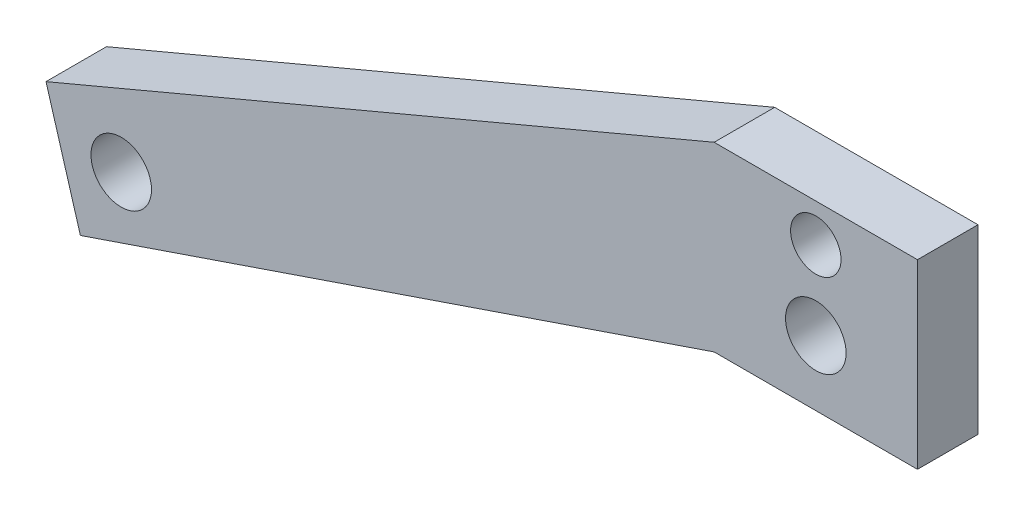
ISO-10303-21;
HEADER;
FILE_DESCRIPTION(('STEP AP214'),'2;1');
FILE_NAME('part.step','',(''),(''),'','','');
FILE_SCHEMA(('AUTOMOTIVE_DESIGN { 1 0 10303 214 1 1 1 1 }'));
ENDSEC;
DATA;
#1=APPLICATION_CONTEXT('core data for automotive mechanical design processes');
#2=APPLICATION_PROTOCOL_DEFINITION('international standard','automotive_design',2000,#1);
#3=PRODUCT_CONTEXT('',#1,'mechanical');
#4=PRODUCT('Part','Part','',(#3));
#5=PRODUCT_RELATED_PRODUCT_CATEGORY('part','',(#4));
#6=PRODUCT_DEFINITION_FORMATION('','',#4);
#7=PRODUCT_DEFINITION_CONTEXT('part definition',#1,'design');
#8=PRODUCT_DEFINITION('design','',#6,#7);
#9=PRODUCT_DEFINITION_SHAPE('','',#8);
#10=(LENGTH_UNIT() NAMED_UNIT(*) SI_UNIT(.MILLI.,.METRE.));
#11=(NAMED_UNIT(*) PLANE_ANGLE_UNIT() SI_UNIT($,.RADIAN.));
#12=(NAMED_UNIT(*) SI_UNIT($,.STERADIAN.) SOLID_ANGLE_UNIT());
#13=UNCERTAINTY_MEASURE_WITH_UNIT(LENGTH_MEASURE(1.E-05),#10,'distance_accuracy_value','');
#14=(GEOMETRIC_REPRESENTATION_CONTEXT(3) GLOBAL_UNCERTAINTY_ASSIGNED_CONTEXT((#13)) GLOBAL_UNIT_ASSIGNED_CONTEXT((#10,
#11,#12)) REPRESENTATION_CONTEXT('',''));
#15=CARTESIAN_POINT('',(0.,0.,0.));
#16=DIRECTION('',(0.,0.,1.));
#17=DIRECTION('',(1.,0.,0.));
#18=AXIS2_PLACEMENT_3D('',#15,#16,#17);
#19=CARTESIAN_POINT('',(-111.181731184165,-32.9335291699961,9.525));
#20=DIRECTION('',(-0.958819734868193,-0.284015344703924,0.));
#21=DIRECTION('',(0.284015344703924,-0.958819734868193,0.));
#22=AXIS2_PLACEMENT_3D('',#19,#20,#21);
#23=PLANE('',#22);
#24=DIRECTION('',(-0.284015344703924,0.958819734868193,0.));
#25=VECTOR('',#24,1.);
#26=CARTESIAN_POINT('',(-111.181731184165,-32.9335291699961,0.));
#27=LINE('',#26,#25);
#28=CARTESIAN_POINT('',(-115.733139183861,-17.5682332698922,0.));
#29=VERTEX_POINT('',#28);
#30=CARTESIAN_POINT('',(-121.143631500471,0.697282679346885,0.));
#31=VERTEX_POINT('',#30);
#32=EDGE_CURVE('E131',#29,#31,#27,.T.);
#33=ORIENTED_EDGE('',*,*,#32,.F.);
#34=DIRECTION('',(0.,0.,-1.));
#35=VECTOR('',#34,1.);
#36=CARTESIAN_POINT('',(-115.733139183861,-17.5682332698922,9.525));
#37=LINE('',#36,#35);
#38=CARTESIAN_POINT('',(-115.733139183861,-17.5682332698922,9.525));
#39=VERTEX_POINT('',#38);
#40=EDGE_CURVE('E11',#39,#29,#37,.T.);
#41=ORIENTED_EDGE('',*,*,#40,.F.);
#42=DIRECTION('',(-0.284015344703924,0.958819734868193,0.));
#43=VECTOR('',#42,1.);
#44=CARTESIAN_POINT('',(-111.181731184165,-32.9335291699961,9.525));
#45=LINE('',#44,#43);
#46=CARTESIAN_POINT('',(-121.143631500471,0.697282679346885,9.525));
#47=VERTEX_POINT('',#46);
#48=EDGE_CURVE('E255',#39,#47,#45,.T.);
#49=ORIENTED_EDGE('',*,*,#48,.T.);
#50=DIRECTION('',(0.,0.,-1.));
#51=VECTOR('',#50,1.);
#52=CARTESIAN_POINT('',(-121.143631500471,0.697282679346885,9.525));
#53=LINE('',#52,#51);
#54=EDGE_CURVE('E81',#47,#31,#53,.T.);
#55=ORIENTED_EDGE('',*,*,#54,.T.);
#56=EDGE_LOOP('',(#33,#41,#49,#55));
#57=FACE_BOUND('',#56,.T.);
#58=ADVANCED_FACE('F36',(#57),#23,.T.);
#59=CARTESIAN_POINT('',(-6.68093946845817,19.6012995194307,9.525));
#60=DIRECTION('',(0.322616747331422,-0.946529679588175,0.));
#61=DIRECTION('',(0.946529679588175,0.322616747331422,0.));
#62=AXIS2_PLACEMENT_3D('',#59,#60,#61);
#63=PLANE('',#62);
#64=DIRECTION('',(-0.946529679588175,-0.322616747331422,0.));
#65=VECTOR('',#64,1.);
#66=CARTESIAN_POINT('',(-6.68093946845817,19.6012995194307,0.));
#67=LINE('',#66,#65);
#68=CARTESIAN_POINT('',(-15.9999937728734,16.4249775796861,0.));
#69=VERTEX_POINT('',#68);
#70=EDGE_CURVE('E129',#69,#29,#67,.T.);
#71=ORIENTED_EDGE('',*,*,#70,.F.);
#72=DIRECTION('',(0.,0.,-1.));
#73=VECTOR('',#72,1.);
#74=CARTESIAN_POINT('',(-15.9999937728734,16.4249775796861,9.525));
#75=LINE('',#74,#73);
#76=CARTESIAN_POINT('',(-15.9999937728734,16.4249775796861,9.525));
#77=VERTEX_POINT('',#76);
#78=EDGE_CURVE('E45',#77,#69,#75,.T.);
#79=ORIENTED_EDGE('',*,*,#78,.F.);
#80=DIRECTION('',(-0.946529679588175,-0.322616747331422,0.));
#81=VECTOR('',#80,1.);
#82=CARTESIAN_POINT('',(-6.68093946845817,19.6012995194307,9.525));
#83=LINE('',#82,#81);
#84=EDGE_CURVE('E256',#77,#39,#83,.T.);
#85=ORIENTED_EDGE('',*,*,#84,.T.);
#86=ORIENTED_EDGE('',*,*,#40,.T.);
#87=EDGE_LOOP('',(#71,#79,#85,#86));
#88=FACE_BOUND('',#87,.T.);
#89=ADVANCED_FACE('F130',(#88),#63,.T.);
#90=CARTESIAN_POINT('',(0.,16.4249775796861,9.525));
#91=DIRECTION('',(0.,-1.,0.));
#92=DIRECTION('',(1.,0.,0.));
#93=AXIS2_PLACEMENT_3D('',#90,#91,#92);
#94=PLANE('',#93);
#95=DIRECTION('',(-1.,0.,0.));
#96=VECTOR('',#95,1.);
#97=CARTESIAN_POINT('',(0.,16.4249775796861,0.));
#98=LINE('',#97,#96);
#99=CARTESIAN_POINT('',(16.0000062271267,16.4249775796861,0.));
#100=VERTEX_POINT('',#99);
#101=EDGE_CURVE('E125',#100,#69,#98,.T.);
#102=ORIENTED_EDGE('',*,*,#101,.F.);
#103=DIRECTION('',(0.,0.,-1.));
#104=VECTOR('',#103,1.);
#105=CARTESIAN_POINT('',(16.0000062271267,16.4249775796861,9.525));
#106=LINE('',#105,#104);
#107=CARTESIAN_POINT('',(16.0000062271267,16.4249775796861,9.525));
#108=VERTEX_POINT('',#107);
#109=EDGE_CURVE('E115',#108,#100,#106,.T.);
#110=ORIENTED_EDGE('',*,*,#109,.F.);
#111=DIRECTION('',(-1.,0.,0.));
#112=VECTOR('',#111,1.);
#113=CARTESIAN_POINT('',(0.,16.4249775796861,9.525));
#114=LINE('',#113,#112);
#115=EDGE_CURVE('E109',#108,#77,#114,.T.);
#116=ORIENTED_EDGE('',*,*,#115,.T.);
#117=ORIENTED_EDGE('',*,*,#78,.T.);
#118=EDGE_LOOP('',(#102,#110,#116,#117));
#119=FACE_BOUND('',#118,.T.);
#120=ADVANCED_FACE('F123',(#119),#94,.T.);
#121=CARTESIAN_POINT('',(16.0000062271267,0.,9.525));
#122=DIRECTION('',(-1.,0.,0.));
#123=DIRECTION('',(0.,-1.,0.));
#124=AXIS2_PLACEMENT_3D('',#121,#122,#123);
#125=PLANE('',#124);
#126=DIRECTION('',(0.,1.,0.));
#127=VECTOR('',#126,1.);
#128=CARTESIAN_POINT('',(16.0000062271267,0.,0.));
#129=LINE('',#128,#127);
#130=CARTESIAN_POINT('',(16.0000062271267,44.9999775796863,0.));
#131=VERTEX_POINT('',#130);
#132=EDGE_CURVE('E114',#100,#131,#129,.T.);
#133=ORIENTED_EDGE('',*,*,#132,.T.);
#134=DIRECTION('',(0.,0.,-1.));
#135=VECTOR('',#134,1.);
#136=CARTESIAN_POINT('',(16.0000062271267,44.9999775796863,9.525));
#137=LINE('',#136,#135);
#138=CARTESIAN_POINT('',(16.0000062271267,44.9999775796863,9.525));
#139=VERTEX_POINT('',#138);
#140=EDGE_CURVE('E99',#139,#131,#137,.T.);
#141=ORIENTED_EDGE('',*,*,#140,.F.);
#142=DIRECTION('',(0.,1.,0.));
#143=VECTOR('',#142,1.);
#144=CARTESIAN_POINT('',(16.0000062271267,0.,9.525));
#145=LINE('',#144,#143);
#146=EDGE_CURVE('E102',#108,#139,#145,.T.);
#147=ORIENTED_EDGE('',*,*,#146,.F.);
#148=ORIENTED_EDGE('',*,*,#109,.T.);
#149=EDGE_LOOP('',(#133,#141,#147,#148));
#150=FACE_BOUND('',#149,.T.);
#151=ADVANCED_FACE('F112',(#150),#125,.F.);
#152=CARTESIAN_POINT('',(0.,44.9999775796863,9.525));
#153=DIRECTION('',(0.,-1.,0.));
#154=DIRECTION('',(0.,0.,-1.));
#155=AXIS2_PLACEMENT_3D('',#152,#153,#154);
#156=PLANE('',#155);
#157=DIRECTION('',(-1.,0.,0.));
#158=VECTOR('',#157,1.);
#159=CARTESIAN_POINT('',(0.,44.9999775796863,0.));
#160=LINE('',#159,#158);
#161=CARTESIAN_POINT('',(-15.9999937728733,44.9999775796863,0.));
#162=VERTEX_POINT('',#161);
#163=EDGE_CURVE('E135',#131,#162,#160,.T.);
#164=ORIENTED_EDGE('',*,*,#163,.T.);
#165=DIRECTION('',(0.,0.,-1.));
#166=VECTOR('',#165,1.);
#167=CARTESIAN_POINT('',(-15.9999937728733,44.9999775796863,9.525));
#168=LINE('',#167,#166);
#169=CARTESIAN_POINT('',(-15.9999937728733,44.9999775796863,9.525));
#170=VERTEX_POINT('',#169);
#171=EDGE_CURVE('E101',#170,#162,#168,.T.);
#172=ORIENTED_EDGE('',*,*,#171,.F.);
#173=DIRECTION('',(-1.,0.,0.));
#174=VECTOR('',#173,1.);
#175=CARTESIAN_POINT('',(0.,44.9999775796863,9.525));
#176=LINE('',#175,#174);
#177=EDGE_CURVE('E94',#139,#170,#176,.T.);
#178=ORIENTED_EDGE('',*,*,#177,.F.);
#179=ORIENTED_EDGE('',*,*,#140,.T.);
#180=EDGE_LOOP('',(#164,#172,#178,#179));
#181=FACE_BOUND('',#180,.T.);
#182=ADVANCED_FACE('F97',(#181),#156,.F.);
#183=CARTESIAN_POINT('',(6.22712671610374E-06,38.9999775796863,9.525));
#184=DIRECTION('',(0.,0.,-1.));
#185=DIRECTION('',(-1.,0.,0.));
#186=AXIS2_PLACEMENT_3D('',#183,#184,#185);
#187=CYLINDRICAL_SURFACE('',#186,3.96875);
#188=CARTESIAN_POINT('',(6.22712671610374E-06,38.9999775796863,9.525));
#189=DIRECTION('',(0.,0.,1.));
#190=DIRECTION('',(1.,0.,0.));
#191=AXIS2_PLACEMENT_3D('',#188,#189,#190);
#192=CIRCLE('',#191,3.96875);
#193=CARTESIAN_POINT('',(3.96875622712672,38.9999775796863,9.525));
#194=VERTEX_POINT('',#193);
#195=EDGE_CURVE('E257',#194,#194,#192,.T.);
#196=ORIENTED_EDGE('',*,*,#195,.T.);
#197=EDGE_LOOP('',(#196));
#198=FACE_BOUND('',#197,.T.);
#199=CARTESIAN_POINT('',(6.22712671610374E-06,38.9999775796863,0.));
#200=DIRECTION('',(0.,0.,1.));
#201=DIRECTION('',(1.,0.,0.));
#202=AXIS2_PLACEMENT_3D('',#199,#200,#201);
#203=CIRCLE('',#202,3.96875);
#204=CARTESIAN_POINT('',(3.96875622712672,38.9999775796863,0.));
#205=VERTEX_POINT('',#204);
#206=EDGE_CURVE('E149',#205,#205,#203,.T.);
#207=ORIENTED_EDGE('',*,*,#206,.F.);
#208=EDGE_LOOP('',(#207));
#209=FACE_BOUND('',#208,.T.);
#210=ADVANCED_FACE('F159',(#198,#209),#187,.F.);
#211=CARTESIAN_POINT('',(6.23902837032508E-06,26.6475746126805,9.525));
#212=DIRECTION('',(0.,0.,-1.));
#213=DIRECTION('',(-1.,0.,0.));
#214=AXIS2_PLACEMENT_3D('',#211,#212,#213);
#215=CYLINDRICAL_SURFACE('',#214,4.76250000164186);
#216=CARTESIAN_POINT('',(6.23902837032508E-06,26.6475746126805,9.525));
#217=DIRECTION('',(0.,0.,1.));
#218=DIRECTION('',(1.,0.,0.));
#219=AXIS2_PLACEMENT_3D('',#216,#217,#218);
#220=CIRCLE('',#219,4.76250000164186);
#221=CARTESIAN_POINT('',(4.76250624067023,26.6475746126805,9.525));
#222=VERTEX_POINT('',#221);
#223=EDGE_CURVE('E173',#222,#222,#220,.T.);
#224=ORIENTED_EDGE('',*,*,#223,.T.);
#225=EDGE_LOOP('',(#224));
#226=FACE_BOUND('',#225,.T.);
#227=CARTESIAN_POINT('',(6.23902837032508E-06,26.6475746126805,0.));
#228=DIRECTION('',(0.,0.,1.));
#229=DIRECTION('',(1.,0.,0.));
#230=AXIS2_PLACEMENT_3D('',#227,#228,#229);
#231=CIRCLE('',#230,4.76250000164186);
#232=CARTESIAN_POINT('',(4.76250624067023,26.6475746126805,0.));
#233=VERTEX_POINT('',#232);
#234=EDGE_CURVE('E146',#233,#233,#231,.T.);
#235=ORIENTED_EDGE('',*,*,#234,.F.);
#236=EDGE_LOOP('',(#235));
#237=FACE_BOUND('',#236,.T.);
#238=ADVANCED_FACE('F161',(#226,#237),#215,.F.);
#239=CARTESIAN_POINT('',(-109.305627367547,-5.73022913696779,9.525));
#240=DIRECTION('',(0.,0.,-1.));
#241=DIRECTION('',(-1.,0.,0.));
#242=AXIS2_PLACEMENT_3D('',#239,#240,#241);
#243=CYLINDRICAL_SURFACE('',#242,4.76250000164186);
#244=CARTESIAN_POINT('',(-109.305627367547,-5.73022913696779,9.525));
#245=DIRECTION('',(0.,0.,1.));
#246=DIRECTION('',(1.,0.,0.));
#247=AXIS2_PLACEMENT_3D('',#244,#245,#246);
#248=CIRCLE('',#247,4.76250000164186);
#249=CARTESIAN_POINT('',(-104.543127365905,-5.73022913696779,9.525));
#250=VERTEX_POINT('',#249);
#251=EDGE_CURVE('E140',#250,#250,#248,.T.);
#252=ORIENTED_EDGE('',*,*,#251,.T.);
#253=EDGE_LOOP('',(#252));
#254=FACE_BOUND('',#253,.T.);
#255=CARTESIAN_POINT('',(-109.305627367547,-5.73022913696779,0.));
#256=DIRECTION('',(0.,0.,1.));
#257=DIRECTION('',(1.,0.,0.));
#258=AXIS2_PLACEMENT_3D('',#255,#256,#257);
#259=CIRCLE('',#258,4.76250000164186);
#260=CARTESIAN_POINT('',(-104.543127365905,-5.73022913696779,0.));
#261=VERTEX_POINT('',#260);
#262=EDGE_CURVE('E143',#261,#261,#259,.T.);
#263=ORIENTED_EDGE('',*,*,#262,.F.);
#264=EDGE_LOOP('',(#263));
#265=FACE_BOUND('',#264,.T.);
#266=ADVANCED_FACE('F38',(#254,#265),#243,.F.);
#267=CARTESIAN_POINT('',(-18.5144984661136,43.9404809077269,9.525));
#268=DIRECTION('',(0.388292906680553,-0.921536010485519,0.));
#269=DIRECTION('',(0.921536010485519,0.388292906680553,0.));
#270=AXIS2_PLACEMENT_3D('',#267,#268,#269);
#271=PLANE('',#270);
#272=DIRECTION('',(-0.921536010485519,-0.388292906680553,0.));
#273=VECTOR('',#272,1.);
#274=CARTESIAN_POINT('',(-18.5144984661136,43.9404809077269,0.));
#275=LINE('',#274,#273);
#276=EDGE_CURVE('E74',#162,#31,#275,.T.);
#277=ORIENTED_EDGE('',*,*,#276,.T.);
#278=ORIENTED_EDGE('',*,*,#54,.F.);
#279=DIRECTION('',(-0.921536010485519,-0.388292906680553,0.));
#280=VECTOR('',#279,1.);
#281=CARTESIAN_POINT('',(-18.5144984661136,43.9404809077269,9.525));
#282=LINE('',#281,#280);
#283=EDGE_CURVE('E53',#170,#47,#282,.T.);
#284=ORIENTED_EDGE('',*,*,#283,.F.);
#285=ORIENTED_EDGE('',*,*,#171,.T.);
#286=EDGE_LOOP('',(#277,#278,#284,#285));
#287=FACE_BOUND('',#286,.T.);
#288=ADVANCED_FACE('F168',(#287),#271,.F.);
#289=CARTESIAN_POINT('',(0.,0.,9.525));
#290=DIRECTION('',(0.,0.,1.));
#291=DIRECTION('',(1.,0.,0.));
#292=AXIS2_PLACEMENT_3D('',#289,#290,#291);
#293=PLANE('',#292);
#294=ORIENTED_EDGE('',*,*,#251,.F.);
#295=EDGE_LOOP('',(#294));
#296=FACE_BOUND('',#295,.T.);
#297=ORIENTED_EDGE('',*,*,#223,.F.);
#298=EDGE_LOOP('',(#297));
#299=FACE_BOUND('',#298,.T.);
#300=ORIENTED_EDGE('',*,*,#195,.F.);
#301=EDGE_LOOP('',(#300));
#302=FACE_BOUND('',#301,.T.);
#303=ORIENTED_EDGE('',*,*,#48,.F.);
#304=ORIENTED_EDGE('',*,*,#84,.F.);
#305=ORIENTED_EDGE('',*,*,#115,.F.);
#306=ORIENTED_EDGE('',*,*,#146,.T.);
#307=ORIENTED_EDGE('',*,*,#177,.T.);
#308=ORIENTED_EDGE('',*,*,#283,.T.);
#309=EDGE_LOOP('',(#303,#304,#305,#306,#307,#308));
#310=FACE_BOUND('',#309,.T.);
#311=ADVANCED_FACE('F106',(#296,#299,#302,#310),#293,.T.);
#312=CARTESIAN_POINT('',(0.,0.,0.));
#313=DIRECTION('',(0.,0.,1.));
#314=DIRECTION('',(1.,0.,0.));
#315=AXIS2_PLACEMENT_3D('',#312,#313,#314);
#316=PLANE('',#315);
#317=ORIENTED_EDGE('',*,*,#262,.T.);
#318=EDGE_LOOP('',(#317));
#319=FACE_BOUND('',#318,.T.);
#320=ORIENTED_EDGE('',*,*,#234,.T.);
#321=EDGE_LOOP('',(#320));
#322=FACE_BOUND('',#321,.T.);
#323=ORIENTED_EDGE('',*,*,#206,.T.);
#324=EDGE_LOOP('',(#323));
#325=FACE_BOUND('',#324,.T.);
#326=ORIENTED_EDGE('',*,*,#32,.T.);
#327=ORIENTED_EDGE('',*,*,#276,.F.);
#328=ORIENTED_EDGE('',*,*,#163,.F.);
#329=ORIENTED_EDGE('',*,*,#132,.F.);
#330=ORIENTED_EDGE('',*,*,#101,.T.);
#331=ORIENTED_EDGE('',*,*,#70,.T.);
#332=EDGE_LOOP('',(#326,#327,#328,#329,#330,#331));
#333=FACE_BOUND('',#332,.T.);
#334=ADVANCED_FACE('F133',(#319,#322,#325,#333),#316,.F.);
#335=CLOSED_SHELL('',(#58,#89,#120,#151,#182,#210,#238,#266,#288,#311,#334));
#336=MANIFOLD_SOLID_BREP('B2',#335);
#337=ADVANCED_BREP_SHAPE_REPRESENTATION('',(#18,#336),#14);
#338=SHAPE_DEFINITION_REPRESENTATION(#9,#337);
ENDSEC;
END-ISO-10303-21;
